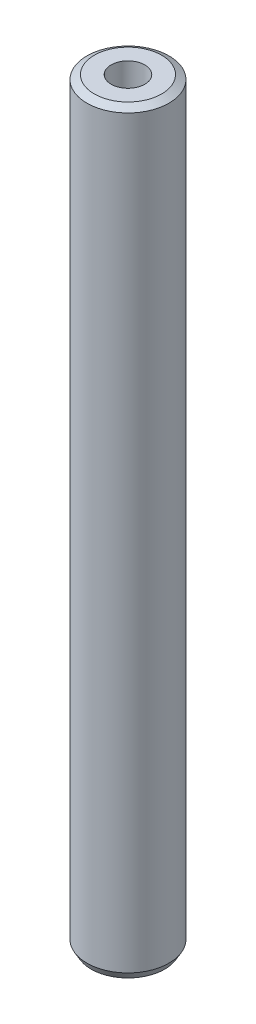
ISO-10303-21;
HEADER;
FILE_DESCRIPTION(('STEP AP214'),'2;1');
FILE_NAME('part.step','',(''),(''),'','','');
FILE_SCHEMA(('AUTOMOTIVE_DESIGN { 1 0 10303 214 1 1 1 1 }'));
ENDSEC;
DATA;
#1=APPLICATION_CONTEXT('core data for automotive mechanical design processes');
#2=APPLICATION_PROTOCOL_DEFINITION('international standard','automotive_design',2000,#1);
#3=PRODUCT_CONTEXT('',#1,'mechanical');
#4=PRODUCT('Part','Part','',(#3));
#5=PRODUCT_RELATED_PRODUCT_CATEGORY('part','',(#4));
#6=PRODUCT_DEFINITION_FORMATION('','',#4);
#7=PRODUCT_DEFINITION_CONTEXT('part definition',#1,'design');
#8=PRODUCT_DEFINITION('design','',#6,#7);
#9=PRODUCT_DEFINITION_SHAPE('','',#8);
#10=(LENGTH_UNIT() NAMED_UNIT(*) SI_UNIT(.MILLI.,.METRE.));
#11=(NAMED_UNIT(*) PLANE_ANGLE_UNIT() SI_UNIT($,.RADIAN.));
#12=(NAMED_UNIT(*) SI_UNIT($,.STERADIAN.) SOLID_ANGLE_UNIT());
#13=UNCERTAINTY_MEASURE_WITH_UNIT(LENGTH_MEASURE(1.E-05),#10,'distance_accuracy_value','');
#14=(GEOMETRIC_REPRESENTATION_CONTEXT(3) GLOBAL_UNCERTAINTY_ASSIGNED_CONTEXT((#13)) GLOBAL_UNIT_ASSIGNED_CONTEXT((#10,
#11,#12)) REPRESENTATION_CONTEXT('',''));
#15=CARTESIAN_POINT('',(0.,0.,0.));
#16=DIRECTION('',(0.,0.,1.));
#17=DIRECTION('',(1.,0.,0.));
#18=AXIS2_PLACEMENT_3D('',#15,#16,#17);
#19=CARTESIAN_POINT('',(0.,368.727452448882,0.));
#20=DIRECTION('',(0.,-1.,0.));
#21=DIRECTION('',(0.,0.,-1.));
#22=AXIS2_PLACEMENT_3D('',#19,#20,#21);
#23=CYLINDRICAL_SURFACE('',#22,20.);
#24=CARTESIAN_POINT('',(0.,366.647007398975,0.));
#25=DIRECTION('',(0.,1.,0.));
#26=DIRECTION('',(0.,0.,1.));
#27=AXIS2_PLACEMENT_3D('',#24,#25,#26);
#28=CIRCLE('',#27,20.);
#29=CARTESIAN_POINT('',(0.,366.647007398975,20.));
#30=VERTEX_POINT('',#29);
#31=EDGE_CURVE('E50',#30,#30,#28,.F.);
#32=ORIENTED_EDGE('',*,*,#31,.T.);
#33=EDGE_LOOP('',(#32));
#34=FACE_BOUND('',#33,.T.);
#35=CARTESIAN_POINT('',(0.,3.60343652879397,0.));
#36=DIRECTION('',(0.,1.,0.));
#37=DIRECTION('',(0.,0.,1.));
#38=AXIS2_PLACEMENT_3D('',#35,#36,#37);
#39=CIRCLE('',#38,20.);
#40=CARTESIAN_POINT('',(0.,3.60343652879397,20.));
#41=VERTEX_POINT('',#40);
#42=EDGE_CURVE('E51',#41,#41,#39,.T.);
#43=ORIENTED_EDGE('',*,*,#42,.T.);
#44=EDGE_LOOP('',(#43));
#45=FACE_BOUND('',#44,.T.);
#46=ADVANCED_FACE('F39',(#34,#45),#23,.T.);
#47=CARTESIAN_POINT('',(0.,368.727452448882,0.));
#48=DIRECTION('',(0.,1.,0.));
#49=DIRECTION('',(0.,0.,1.));
#50=AXIS2_PLACEMENT_3D('',#47,#48,#49);
#51=PLANE('',#50);
#52=CARTESIAN_POINT('',(0.,368.727452448882,0.));
#53=DIRECTION('',(0.,1.,0.));
#54=DIRECTION('',(0.,0.,1.));
#55=AXIS2_PLACEMENT_3D('',#52,#53,#54);
#56=CIRCLE('',#55,16.3965634712061);
#57=CARTESIAN_POINT('',(0.,368.727452448882,16.3965634712061));
#58=VERTEX_POINT('',#57);
#59=EDGE_CURVE('E54',#58,#58,#56,.T.);
#60=ORIENTED_EDGE('',*,*,#59,.T.);
#61=EDGE_LOOP('',(#60));
#62=FACE_BOUND('',#61,.T.);
#63=CARTESIAN_POINT('',(0.,368.727452448882,0.));
#64=DIRECTION('',(0.,1.,0.));
#65=DIRECTION('',(0.,0.,1.));
#66=AXIS2_PLACEMENT_3D('',#63,#64,#65);
#67=CIRCLE('',#66,8.20100069802872);
#68=CARTESIAN_POINT('',(0.,368.727452448882,8.20100069802872));
#69=VERTEX_POINT('',#68);
#70=EDGE_CURVE('E58',#69,#69,#67,.T.);
#71=ORIENTED_EDGE('',*,*,#70,.F.);
#72=EDGE_LOOP('',(#71));
#73=FACE_BOUND('',#72,.T.);
#74=ADVANCED_FACE('F69',(#62,#73),#51,.T.);
#75=CARTESIAN_POINT('',(0.,0.,0.));
#76=DIRECTION('',(0.,1.,0.));
#77=DIRECTION('',(0.,0.,1.));
#78=AXIS2_PLACEMENT_3D('',#75,#76,#77);
#79=PLANE('',#78);
#80=CARTESIAN_POINT('',(0.,0.,0.));
#81=DIRECTION('',(0.,1.,0.));
#82=DIRECTION('',(0.,0.,1.));
#83=AXIS2_PLACEMENT_3D('',#80,#81,#82);
#84=CIRCLE('',#83,17.919554950093);
#85=CARTESIAN_POINT('',(0.,0.,17.919554950093));
#86=VERTEX_POINT('',#85);
#87=EDGE_CURVE('E10',#86,#86,#84,.F.);
#88=ORIENTED_EDGE('',*,*,#87,.T.);
#89=EDGE_LOOP('',(#88));
#90=FACE_BOUND('',#89,.T.);
#91=CARTESIAN_POINT('',(0.,0.,0.));
#92=DIRECTION('',(0.,1.,0.));
#93=DIRECTION('',(0.,0.,1.));
#94=AXIS2_PLACEMENT_3D('',#91,#92,#93);
#95=CIRCLE('',#94,8.20100069802872);
#96=CARTESIAN_POINT('',(0.,0.,8.20100069802872));
#97=VERTEX_POINT('',#96);
#98=EDGE_CURVE('E63',#97,#97,#95,.T.);
#99=ORIENTED_EDGE('',*,*,#98,.T.);
#100=EDGE_LOOP('',(#99));
#101=FACE_BOUND('',#100,.T.);
#102=ADVANCED_FACE('F75',(#90,#101),#79,.F.);
#103=CARTESIAN_POINT('',(0.,368.727452448882,0.));
#104=DIRECTION('',(0.,-1.,0.));
#105=DIRECTION('',(0.,0.,-1.));
#106=AXIS2_PLACEMENT_3D('',#103,#104,#105);
#107=CYLINDRICAL_SURFACE('',#106,8.20100069802872);
#108=ORIENTED_EDGE('',*,*,#70,.T.);
#109=EDGE_LOOP('',(#108));
#110=FACE_BOUND('',#109,.T.);
#111=ORIENTED_EDGE('',*,*,#98,.F.);
#112=EDGE_LOOP('',(#111));
#113=FACE_BOUND('',#112,.T.);
#114=ADVANCED_FACE('F70',(#110,#113),#107,.F.);
#115=CARTESIAN_POINT('',(0.,368.727452448882,0.));
#116=DIRECTION('',(0.,-1.,0.));
#117=DIRECTION('',(0.,0.,-1.));
#118=AXIS2_PLACEMENT_3D('',#115,#116,#117);
#119=CONICAL_SURFACE('',#118,16.3965634712061,1.04719755119659);
#120=ORIENTED_EDGE('',*,*,#31,.F.);
#121=EDGE_LOOP('',(#120));
#122=FACE_BOUND('',#121,.T.);
#123=ORIENTED_EDGE('',*,*,#59,.F.);
#124=EDGE_LOOP('',(#123));
#125=FACE_BOUND('',#124,.T.);
#126=ADVANCED_FACE('F81',(#122,#125),#119,.T.);
#127=CARTESIAN_POINT('',(0.,3.60343652879397,0.));
#128=DIRECTION('',(0.,1.,0.));
#129=DIRECTION('',(0.,0.,1.));
#130=AXIS2_PLACEMENT_3D('',#127,#128,#129);
#131=CONICAL_SURFACE('',#130,20.,0.523598775598306);
#132=ORIENTED_EDGE('',*,*,#87,.F.);
#133=EDGE_LOOP('',(#132));
#134=FACE_BOUND('',#133,.T.);
#135=ORIENTED_EDGE('',*,*,#42,.F.);
#136=EDGE_LOOP('',(#135));
#137=FACE_BOUND('',#136,.T.);
#138=ADVANCED_FACE('F45',(#134,#137),#131,.T.);
#139=CLOSED_SHELL('',(#46,#74,#102,#114,#126,#138));
#140=MANIFOLD_SOLID_BREP('B2',#139);
#141=ADVANCED_BREP_SHAPE_REPRESENTATION('',(#18,#140),#14);
#142=SHAPE_DEFINITION_REPRESENTATION(#9,#141);
ENDSEC;
END-ISO-10303-21;
